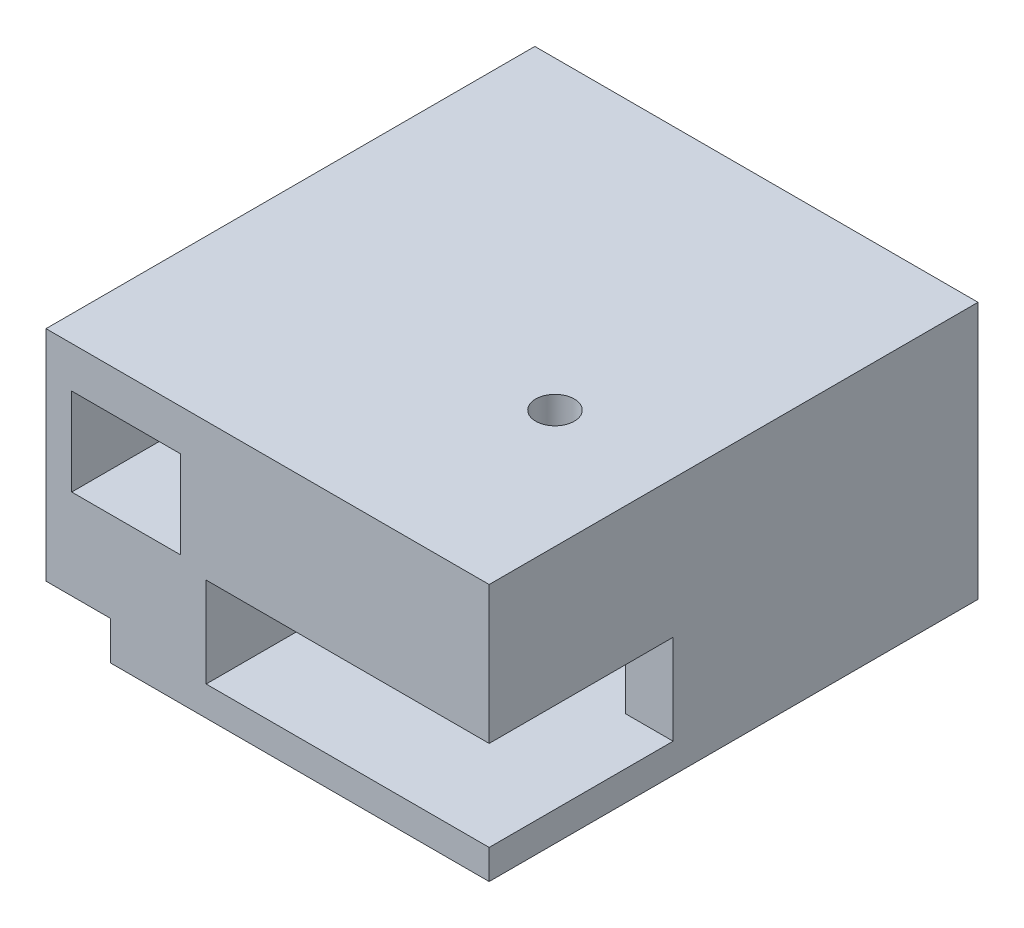
ISO-10303-21;
HEADER;
FILE_DESCRIPTION(('STEP AP214'),'2;1');
FILE_NAME('part.step','',(''),(''),'','','');
FILE_SCHEMA(('AUTOMOTIVE_DESIGN { 1 0 10303 214 1 1 1 1 }'));
ENDSEC;
DATA;
#1=APPLICATION_CONTEXT('core data for automotive mechanical design processes');
#2=APPLICATION_PROTOCOL_DEFINITION('international standard','automotive_design',2000,#1);
#3=PRODUCT_CONTEXT('',#1,'mechanical');
#4=PRODUCT('Part','Part','',(#3));
#5=PRODUCT_RELATED_PRODUCT_CATEGORY('part','',(#4));
#6=PRODUCT_DEFINITION_FORMATION('','',#4);
#7=PRODUCT_DEFINITION_CONTEXT('part definition',#1,'design');
#8=PRODUCT_DEFINITION('design','',#6,#7);
#9=PRODUCT_DEFINITION_SHAPE('','',#8);
#10=(LENGTH_UNIT() NAMED_UNIT(*) SI_UNIT(.MILLI.,.METRE.));
#11=(NAMED_UNIT(*) PLANE_ANGLE_UNIT() SI_UNIT($,.RADIAN.));
#12=(NAMED_UNIT(*) SI_UNIT($,.STERADIAN.) SOLID_ANGLE_UNIT());
#13=UNCERTAINTY_MEASURE_WITH_UNIT(LENGTH_MEASURE(1.E-05),#10,'distance_accuracy_value','');
#14=(GEOMETRIC_REPRESENTATION_CONTEXT(3) GLOBAL_UNCERTAINTY_ASSIGNED_CONTEXT((#13)) GLOBAL_UNIT_ASSIGNED_CONTEXT((#10,
#11,#12)) REPRESENTATION_CONTEXT('',''));
#15=CARTESIAN_POINT('',(0.,0.,0.));
#16=DIRECTION('',(0.,0.,1.));
#17=DIRECTION('',(1.,0.,0.));
#18=AXIS2_PLACEMENT_3D('',#15,#16,#17);
#19=CARTESIAN_POINT('',(12.125,-500000.,0.));
#20=DIRECTION('',(1.,0.,0.));
#21=DIRECTION('',(0.,0.,1.));
#22=AXIS2_PLACEMENT_3D('',#19,#20,#21);
#23=PLANE('',#22);
#24=DIRECTION('',(0.,-1.,0.));
#25=VECTOR('',#24,1.);
#26=CARTESIAN_POINT('',(12.125,28.9501505877455,18.4638204994987));
#27=LINE('',#26,#25);
#28=CARTESIAN_POINT('',(12.125,-2.70000000000437,18.4638204994987));
#29=VERTEX_POINT('',#28);
#30=CARTESIAN_POINT('',(12.125,4.3,18.4638204994987));
#31=VERTEX_POINT('',#30);
#32=EDGE_CURVE('E11',#29,#31,#27,.F.);
#33=ORIENTED_EDGE('',*,*,#32,.T.);
#34=DIRECTION('',(0.,0.,1.));
#35=VECTOR('',#34,1.);
#36=CARTESIAN_POINT('',(12.125,4.3,0.));
#37=LINE('',#36,#35);
#38=CARTESIAN_POINT('',(12.125,4.3,0.));
#39=VERTEX_POINT('',#38);
#40=EDGE_CURVE('E440',#39,#31,#37,.T.);
#41=ORIENTED_EDGE('',*,*,#40,.F.);
#42=DIRECTION('',(0.,1.,0.));
#43=VECTOR('',#42,1.);
#44=CARTESIAN_POINT('',(12.125,-500000.,0.));
#45=LINE('',#44,#43);
#46=CARTESIAN_POINT('',(12.125,-2.70000000011805,0.));
#47=VERTEX_POINT('',#46);
#48=EDGE_CURVE('E328',#47,#39,#45,.T.);
#49=ORIENTED_EDGE('',*,*,#48,.F.);
#50=DIRECTION('',(0.,0.,-1.));
#51=VECTOR('',#50,1.);
#52=CARTESIAN_POINT('',(12.125,-2.70000000000437,0.));
#53=LINE('',#52,#51);
#54=EDGE_CURVE('E321',#29,#47,#53,.T.);
#55=ORIENTED_EDGE('',*,*,#54,.F.);
#56=EDGE_LOOP('',(#33,#41,#49,#55));
#57=FACE_BOUND('',#56,.T.);
#58=ADVANCED_FACE('F43',(#57),#23,.F.);
#59=CARTESIAN_POINT('',(0.,5.,38.));
#60=DIRECTION('',(0.,1.,0.));
#61=DIRECTION('',(-1.,0.,0.));
#62=AXIS2_PLACEMENT_3D('',#59,#60,#61);
#63=PLANE('',#62);
#64=DIRECTION('',(-1.,0.,0.));
#65=VECTOR('',#64,1.);
#66=CARTESIAN_POINT('',(3.82743866176395,5.,7.81246621596943));
#67=LINE('',#66,#65);
#68=CARTESIAN_POINT('',(-4.375,5.,7.81246621596943));
#69=VERTEX_POINT('',#68);
#70=CARTESIAN_POINT('',(-12.825,5.,7.81246621596943));
#71=VERTEX_POINT('',#70);
#72=EDGE_CURVE('E495',#69,#71,#67,.T.);
#73=ORIENTED_EDGE('',*,*,#72,.T.);
#74=DIRECTION('',(0.,0.,1.));
#75=VECTOR('',#74,1.);
#76=CARTESIAN_POINT('',(-12.825,5.,38.));
#77=LINE('',#76,#75);
#78=CARTESIAN_POINT('',(-12.825,5.,38.));
#79=VERTEX_POINT('',#78);
#80=EDGE_CURVE('E442',#71,#79,#77,.T.);
#81=ORIENTED_EDGE('',*,*,#80,.T.);
#82=DIRECTION('',(-1.,0.,0.));
#83=VECTOR('',#82,1.);
#84=CARTESIAN_POINT('',(0.,5.,38.));
#85=LINE('',#84,#83);
#86=CARTESIAN_POINT('',(-4.375,5.,38.));
#87=VERTEX_POINT('',#86);
#88=EDGE_CURVE('E273',#87,#79,#85,.T.);
#89=ORIENTED_EDGE('',*,*,#88,.F.);
#90=DIRECTION('',(0.,0.,-1.));
#91=VECTOR('',#90,1.);
#92=CARTESIAN_POINT('',(-4.375,5.,38.));
#93=LINE('',#92,#91);
#94=EDGE_CURVE('E477',#87,#69,#93,.T.);
#95=ORIENTED_EDGE('',*,*,#94,.T.);
#96=EDGE_LOOP('',(#73,#81,#89,#95));
#97=FACE_BOUND('',#96,.T.);
#98=ADVANCED_FACE('F511',(#97),#63,.T.);
#99=CARTESIAN_POINT('',(0.,-2.7,38.));
#100=DIRECTION('',(0.,1.,0.));
#101=DIRECTION('',(-1.,0.,0.));
#102=AXIS2_PLACEMENT_3D('',#99,#100,#101);
#103=PLANE('',#102);
#104=CARTESIAN_POINT('',(10.44201924,-2.7,23.7));
#105=DIRECTION('',(0.,-1.,0.));
#106=DIRECTION('',(-1.,0.,0.));
#107=AXIS2_PLACEMENT_3D('',#104,#105,#106);
#108=CIRCLE('',#107,1.5);
#109=CARTESIAN_POINT('',(8.94201924000001,-2.7,23.7));
#110=VERTEX_POINT('',#109);
#111=EDGE_CURVE('E398',#110,#110,#108,.F.);
#112=ORIENTED_EDGE('',*,*,#111,.F.);
#113=EDGE_LOOP('',(#112));
#114=FACE_BOUND('',#113,.T.);
#115=DIRECTION('',(-1.,0.,0.));
#116=VECTOR('',#115,1.);
#117=CARTESIAN_POINT('',(0.,-2.7,38.));
#118=LINE('',#117,#116);
#119=CARTESIAN_POINT('',(19.625,-2.7,38.));
#120=VERTEX_POINT('',#119);
#121=CARTESIAN_POINT('',(-2.375,-2.7,38.));
#122=VERTEX_POINT('',#121);
#123=EDGE_CURVE('E230',#120,#122,#118,.T.);
#124=ORIENTED_EDGE('',*,*,#123,.F.);
#125=DIRECTION('',(0.,0.,1.));
#126=VECTOR('',#125,1.);
#127=CARTESIAN_POINT('',(19.625,-2.7,0.));
#128=LINE('',#127,#126);
#129=CARTESIAN_POINT('',(19.625,-2.7,23.7));
#130=VERTEX_POINT('',#129);
#131=EDGE_CURVE('E241',#130,#120,#128,.T.);
#132=ORIENTED_EDGE('',*,*,#131,.F.);
#133=DIRECTION('',(1.,0.,0.));
#134=VECTOR('',#133,1.);
#135=CARTESIAN_POINT('',(0.,-2.7,23.7));
#136=LINE('',#135,#134);
#137=CARTESIAN_POINT('',(15.94201924,-2.7,23.7));
#138=VERTEX_POINT('',#137);
#139=EDGE_CURVE('E431',#138,#130,#136,.T.);
#140=ORIENTED_EDGE('',*,*,#139,.F.);
#141=CARTESIAN_POINT('',(10.44201924,-2.7,23.7));
#142=DIRECTION('',(0.,-1.,0.));
#143=DIRECTION('',(-1.,0.,0.));
#144=AXIS2_PLACEMENT_3D('',#141,#142,#143);
#145=CIRCLE('',#144,5.5);
#146=EDGE_CURVE('E62',#29,#138,#145,.T.);
#147=ORIENTED_EDGE('',*,*,#146,.F.);
#148=ORIENTED_EDGE('',*,*,#54,.T.);
#149=DIRECTION('',(-1.,0.,0.));
#150=VECTOR('',#149,1.);
#151=CARTESIAN_POINT('',(0.,-2.7,0.));
#152=LINE('',#151,#150);
#153=CARTESIAN_POINT('',(-2.375,-2.7,0.));
#154=VERTEX_POINT('',#153);
#155=EDGE_CURVE('E260',#47,#154,#152,.T.);
#156=ORIENTED_EDGE('',*,*,#155,.T.);
#157=DIRECTION('',(0.,0.,-1.));
#158=VECTOR('',#157,1.);
#159=CARTESIAN_POINT('',(-2.375,-2.7,38.));
#160=LINE('',#159,#158);
#161=EDGE_CURVE('E52',#122,#154,#160,.T.);
#162=ORIENTED_EDGE('',*,*,#161,.F.);
#163=EDGE_LOOP('',(#124,#132,#140,#147,#148,#156,#162));
#164=FACE_BOUND('',#163,.T.);
#165=ADVANCED_FACE('F45',(#114,#164),#103,.T.);
#166=CARTESIAN_POINT('',(0.,4.3,38.));
#167=DIRECTION('',(0.,1.,0.));
#168=DIRECTION('',(0.,0.,-1.));
#169=AXIS2_PLACEMENT_3D('',#166,#167,#168);
#170=PLANE('',#169);
#171=DIRECTION('',(0.,0.,-1.));
#172=VECTOR('',#171,1.);
#173=CARTESIAN_POINT('',(-2.375,4.3,38.));
#174=LINE('',#173,#172);
#175=CARTESIAN_POINT('',(-2.375,4.3,38.));
#176=VERTEX_POINT('',#175);
#177=CARTESIAN_POINT('',(-2.375,4.3,0.));
#178=VERTEX_POINT('',#177);
#179=EDGE_CURVE('E280',#176,#178,#174,.T.);
#180=ORIENTED_EDGE('',*,*,#179,.T.);
#181=DIRECTION('',(-1.,0.,0.));
#182=VECTOR('',#181,1.);
#183=CARTESIAN_POINT('',(0.,4.3,0.));
#184=LINE('',#183,#182);
#185=EDGE_CURVE('E330',#39,#178,#184,.T.);
#186=ORIENTED_EDGE('',*,*,#185,.F.);
#187=ORIENTED_EDGE('',*,*,#40,.T.);
#188=CARTESIAN_POINT('',(10.44201924,4.3,23.7));
#189=DIRECTION('',(0.,-1.,0.));
#190=DIRECTION('',(0.,0.,-1.));
#191=AXIS2_PLACEMENT_3D('',#188,#189,#190);
#192=CIRCLE('',#191,5.5);
#193=CARTESIAN_POINT('',(15.94201924,4.3,23.7));
#194=VERTEX_POINT('',#193);
#195=EDGE_CURVE('E428',#31,#194,#192,.T.);
#196=ORIENTED_EDGE('',*,*,#195,.T.);
#197=DIRECTION('',(1.,0.,0.));
#198=VECTOR('',#197,1.);
#199=CARTESIAN_POINT('',(0.,4.3,23.7));
#200=LINE('',#199,#198);
#201=CARTESIAN_POINT('',(19.625,4.3,23.7));
#202=VERTEX_POINT('',#201);
#203=EDGE_CURVE('E424',#194,#202,#200,.T.);
#204=ORIENTED_EDGE('',*,*,#203,.T.);
#205=DIRECTION('',(0.,0.,1.));
#206=VECTOR('',#205,1.);
#207=CARTESIAN_POINT('',(19.625,4.3,0.));
#208=LINE('',#207,#206);
#209=CARTESIAN_POINT('',(19.625,4.3,38.));
#210=VERTEX_POINT('',#209);
#211=EDGE_CURVE('E427',#202,#210,#208,.T.);
#212=ORIENTED_EDGE('',*,*,#211,.T.);
#213=DIRECTION('',(-1.,0.,0.));
#214=VECTOR('',#213,1.);
#215=CARTESIAN_POINT('',(0.,4.3,38.));
#216=LINE('',#215,#214);
#217=EDGE_CURVE('E342',#210,#176,#216,.T.);
#218=ORIENTED_EDGE('',*,*,#217,.T.);
#219=EDGE_LOOP('',(#180,#186,#187,#196,#204,#212,#218));
#220=FACE_BOUND('',#219,.T.);
#221=CARTESIAN_POINT('',(10.44201924,4.3,23.7));
#222=DIRECTION('',(0.,-1.,0.));
#223=DIRECTION('',(0.,0.,-1.));
#224=AXIS2_PLACEMENT_3D('',#221,#222,#223);
#225=CIRCLE('',#224,1.5);
#226=CARTESIAN_POINT('',(10.44201924,4.3,22.2));
#227=VERTEX_POINT('',#226);
#228=EDGE_CURVE('E436',#227,#227,#225,.F.);
#229=ORIENTED_EDGE('',*,*,#228,.T.);
#230=EDGE_LOOP('',(#229));
#231=FACE_BOUND('',#230,.T.);
#232=ADVANCED_FACE('F540',(#220,#231),#170,.F.);
#233=DIRECTION('',(-1.,0.,0.));
#234=VECTOR('',#233,1.);
#235=CARTESIAN_POINT('',(3.82743866176395,5.,3.18753378403057));
#236=LINE('',#235,#234);
#237=CARTESIAN_POINT('',(-12.825,5.,3.18753378403057));
#238=VERTEX_POINT('',#237);
#239=CARTESIAN_POINT('',(-4.375,5.,3.18753378403057));
#240=VERTEX_POINT('',#239);
#241=EDGE_CURVE('E499',#238,#240,#236,.F.);
#242=ORIENTED_EDGE('',*,*,#241,.T.);
#243=CARTESIAN_POINT('',(-4.375,5.,0.));
#244=VERTEX_POINT('',#243);
#245=EDGE_CURVE('E481',#240,#244,#93,.T.);
#246=ORIENTED_EDGE('',*,*,#245,.T.);
#247=DIRECTION('',(-1.,0.,0.));
#248=VECTOR('',#247,1.);
#249=CARTESIAN_POINT('',(0.,5.,0.));
#250=LINE('',#249,#248);
#251=CARTESIAN_POINT('',(-12.825,5.,0.));
#252=VERTEX_POINT('',#251);
#253=EDGE_CURVE('E297',#244,#252,#250,.T.);
#254=ORIENTED_EDGE('',*,*,#253,.T.);
#255=EDGE_CURVE('E393',#252,#238,#77,.T.);
#256=ORIENTED_EDGE('',*,*,#255,.T.);
#257=EDGE_LOOP('',(#242,#246,#254,#256));
#258=FACE_BOUND('',#257,.T.);
#259=ADVANCED_FACE('F527',(#258),#63,.T.);
#260=CARTESIAN_POINT('',(0.,11.8,38.));
#261=DIRECTION('',(0.,1.,0.));
#262=DIRECTION('',(-1.,0.,0.));
#263=AXIS2_PLACEMENT_3D('',#260,#261,#262);
#264=PLANE('',#263);
#265=DIRECTION('',(0.,0.,1.));
#266=VECTOR('',#265,1.);
#267=CARTESIAN_POINT('',(-12.825,11.7999999999938,38.));
#268=LINE('',#267,#266);
#269=CARTESIAN_POINT('',(-12.825,11.7999999999938,0.));
#270=VERTEX_POINT('',#269);
#271=CARTESIAN_POINT('',(-12.825,11.7999999999938,38.));
#272=VERTEX_POINT('',#271);
#273=EDGE_CURVE('E482',#270,#272,#268,.T.);
#274=ORIENTED_EDGE('',*,*,#273,.F.);
#275=DIRECTION('',(-1.,0.,0.));
#276=VECTOR('',#275,1.);
#277=CARTESIAN_POINT('',(0.,11.8,0.));
#278=LINE('',#277,#276);
#279=CARTESIAN_POINT('',(-4.375,11.7999999999938,0.));
#280=VERTEX_POINT('',#279);
#281=EDGE_CURVE('E373',#280,#270,#278,.T.);
#282=ORIENTED_EDGE('',*,*,#281,.F.);
#283=DIRECTION('',(0.,0.,-1.));
#284=VECTOR('',#283,1.);
#285=CARTESIAN_POINT('',(-4.375,11.7999999999938,38.));
#286=LINE('',#285,#284);
#287=CARTESIAN_POINT('',(-4.375,11.8,38.));
#288=VERTEX_POINT('',#287);
#289=EDGE_CURVE('E451',#288,#280,#286,.T.);
#290=ORIENTED_EDGE('',*,*,#289,.F.);
#291=DIRECTION('',(-1.,0.,0.));
#292=VECTOR('',#291,1.);
#293=CARTESIAN_POINT('',(0.,11.8,38.));
#294=LINE('',#293,#292);
#295=EDGE_CURVE('E378',#288,#272,#294,.T.);
#296=ORIENTED_EDGE('',*,*,#295,.T.);
#297=EDGE_LOOP('',(#274,#282,#290,#296));
#298=FACE_BOUND('',#297,.T.);
#299=ADVANCED_FACE('F531',(#298),#264,.F.);
#300=CARTESIAN_POINT('',(-9.825,0.,38.));
#301=DIRECTION('',(-1.,0.,0.));
#302=DIRECTION('',(0.,0.,-1.));
#303=AXIS2_PLACEMENT_3D('',#300,#301,#302);
#304=PLANE('',#303);
#305=DIRECTION('',(0.,0.,-1.));
#306=VECTOR('',#305,1.);
#307=CARTESIAN_POINT('',(-9.825,-5.,38.));
#308=LINE('',#307,#306);
#309=CARTESIAN_POINT('',(-9.825,-5.,38.));
#310=VERTEX_POINT('',#309);
#311=CARTESIAN_POINT('',(-9.825,-5.,16.));
#312=VERTEX_POINT('',#311);
#313=EDGE_CURVE('E304',#310,#312,#308,.T.);
#314=ORIENTED_EDGE('',*,*,#313,.F.);
#315=DIRECTION('',(0.,-1.,0.));
#316=VECTOR('',#315,1.);
#317=CARTESIAN_POINT('',(-9.825,0.,38.));
#318=LINE('',#317,#316);
#319=CARTESIAN_POINT('',(-9.825,-2.,38.));
#320=VERTEX_POINT('',#319);
#321=EDGE_CURVE('E292',#320,#310,#318,.T.);
#322=ORIENTED_EDGE('',*,*,#321,.F.);
#323=DIRECTION('',(0.,0.,-1.));
#324=VECTOR('',#323,1.);
#325=CARTESIAN_POINT('',(-9.825,-2.,38.));
#326=LINE('',#325,#324);
#327=CARTESIAN_POINT('',(-9.825,-2.,16.));
#328=VERTEX_POINT('',#327);
#329=EDGE_CURVE('E308',#320,#328,#326,.T.);
#330=ORIENTED_EDGE('',*,*,#329,.T.);
#331=DIRECTION('',(0.,-1.,0.));
#332=VECTOR('',#331,1.);
#333=CARTESIAN_POINT('',(-9.825,0.,16.));
#334=LINE('',#333,#332);
#335=EDGE_CURVE('E237',#328,#312,#334,.T.);
#336=ORIENTED_EDGE('',*,*,#335,.T.);
#337=EDGE_LOOP('',(#314,#322,#330,#336));
#338=FACE_BOUND('',#337,.T.);
#339=ADVANCED_FACE('F420',(#338),#304,.T.);
#340=CARTESIAN_POINT('',(0.,-2.,38.));
#341=DIRECTION('',(0.,-1.,0.));
#342=DIRECTION('',(0.,0.,1.));
#343=AXIS2_PLACEMENT_3D('',#340,#341,#342);
#344=PLANE('',#343);
#345=ORIENTED_EDGE('',*,*,#329,.F.);
#346=DIRECTION('',(1.,0.,0.));
#347=VECTOR('',#346,1.);
#348=CARTESIAN_POINT('',(0.,-2.,38.));
#349=LINE('',#348,#347);
#350=CARTESIAN_POINT('',(-14.825,-2.,38.));
#351=VERTEX_POINT('',#350);
#352=EDGE_CURVE('E289',#351,#320,#349,.T.);
#353=ORIENTED_EDGE('',*,*,#352,.F.);
#354=DIRECTION('',(0.,0.,-1.));
#355=VECTOR('',#354,1.);
#356=CARTESIAN_POINT('',(-14.825,-2.,38.));
#357=LINE('',#356,#355);
#358=CARTESIAN_POINT('',(-14.825,-2.,16.));
#359=VERTEX_POINT('',#358);
#360=EDGE_CURVE('E294',#351,#359,#357,.T.);
#361=ORIENTED_EDGE('',*,*,#360,.T.);
#362=DIRECTION('',(1.,0.,0.));
#363=VECTOR('',#362,1.);
#364=CARTESIAN_POINT('',(0.,-2.,16.));
#365=LINE('',#364,#363);
#366=EDGE_CURVE('E405',#359,#328,#365,.T.);
#367=ORIENTED_EDGE('',*,*,#366,.T.);
#368=EDGE_LOOP('',(#345,#353,#361,#367));
#369=FACE_BOUND('',#368,.T.);
#370=ADVANCED_FACE('F416',(#369),#344,.T.);
#371=CARTESIAN_POINT('',(-2.375,0.,38.));
#372=DIRECTION('',(-1.,0.,0.));
#373=DIRECTION('',(0.,-1.,0.));
#374=AXIS2_PLACEMENT_3D('',#371,#372,#373);
#375=PLANE('',#374);
#376=ORIENTED_EDGE('',*,*,#179,.F.);
#377=DIRECTION('',(0.,-1.,0.));
#378=VECTOR('',#377,1.);
#379=CARTESIAN_POINT('',(-2.375,0.,38.));
#380=LINE('',#379,#378);
#381=EDGE_CURVE('E270',#176,#122,#380,.T.);
#382=ORIENTED_EDGE('',*,*,#381,.T.);
#383=ORIENTED_EDGE('',*,*,#161,.T.);
#384=DIRECTION('',(0.,-1.,0.));
#385=VECTOR('',#384,1.);
#386=CARTESIAN_POINT('',(-2.375,0.,0.));
#387=LINE('',#386,#385);
#388=EDGE_CURVE('E275',#178,#154,#387,.T.);
#389=ORIENTED_EDGE('',*,*,#388,.F.);
#390=EDGE_LOOP('',(#376,#382,#383,#389));
#391=FACE_BOUND('',#390,.T.);
#392=ADVANCED_FACE('F319',(#391),#375,.F.);
#393=CARTESIAN_POINT('',(0.,-5.,38.));
#394=DIRECTION('',(0.,1.,0.));
#395=DIRECTION('',(-1.,0.,0.));
#396=AXIS2_PLACEMENT_3D('',#393,#394,#395);
#397=PLANE('',#396);
#398=CARTESIAN_POINT('',(10.44201924,-5.,23.7));
#399=DIRECTION('',(0.,-1.,0.));
#400=DIRECTION('',(-1.,0.,0.));
#401=AXIS2_PLACEMENT_3D('',#398,#399,#400);
#402=CIRCLE('',#401,1.5);
#403=CARTESIAN_POINT('',(8.94201924000001,-5.,23.7));
#404=VERTEX_POINT('',#403);
#405=EDGE_CURVE('E465',#404,#404,#402,.F.);
#406=ORIENTED_EDGE('',*,*,#405,.T.);
#407=EDGE_LOOP('',(#406));
#408=FACE_BOUND('',#407,.T.);
#409=DIRECTION('',(-1.,0.,0.));
#410=VECTOR('',#409,1.);
#411=CARTESIAN_POINT('',(0.,-5.,0.));
#412=LINE('',#411,#410);
#413=CARTESIAN_POINT('',(19.625,-5.,0.));
#414=VERTEX_POINT('',#413);
#415=CARTESIAN_POINT('',(-14.825,-5.,0.));
#416=VERTEX_POINT('',#415);
#417=EDGE_CURVE('E253',#414,#416,#412,.T.);
#418=ORIENTED_EDGE('',*,*,#417,.F.);
#419=DIRECTION('',(0.,0.,1.));
#420=VECTOR('',#419,1.);
#421=CARTESIAN_POINT('',(19.625,-5.,0.));
#422=LINE('',#421,#420);
#423=CARTESIAN_POINT('',(19.625,-5.,38.));
#424=VERTEX_POINT('',#423);
#425=EDGE_CURVE('E395',#414,#424,#422,.T.);
#426=ORIENTED_EDGE('',*,*,#425,.T.);
#427=DIRECTION('',(-1.,0.,0.));
#428=VECTOR('',#427,1.);
#429=CARTESIAN_POINT('',(0.,-5.,38.));
#430=LINE('',#429,#428);
#431=EDGE_CURVE('E232',#424,#310,#430,.T.);
#432=ORIENTED_EDGE('',*,*,#431,.T.);
#433=ORIENTED_EDGE('',*,*,#313,.T.);
#434=DIRECTION('',(-1.,0.,0.));
#435=VECTOR('',#434,1.);
#436=CARTESIAN_POINT('',(0.,-5.,16.));
#437=LINE('',#436,#435);
#438=CARTESIAN_POINT('',(-14.825,-5.,16.));
#439=VERTEX_POINT('',#438);
#440=EDGE_CURVE('E372',#312,#439,#437,.T.);
#441=ORIENTED_EDGE('',*,*,#440,.T.);
#442=DIRECTION('',(0.,0.,-1.));
#443=VECTOR('',#442,1.);
#444=CARTESIAN_POINT('',(-14.825,-5.,16.));
#445=LINE('',#444,#443);
#446=EDGE_CURVE('E368',#439,#416,#445,.T.);
#447=ORIENTED_EDGE('',*,*,#446,.T.);
#448=EDGE_LOOP('',(#418,#426,#432,#433,#441,#447));
#449=FACE_BOUND('',#448,.T.);
#450=ADVANCED_FACE('F371',(#408,#449),#397,.F.);
#451=CARTESIAN_POINT('',(0.,0.,38.));
#452=DIRECTION('',(0.,0.,-1.));
#453=DIRECTION('',(1.,0.,0.));
#454=AXIS2_PLACEMENT_3D('',#451,#452,#453);
#455=PLANE('',#454);
#456=DIRECTION('',(0.,1.,0.));
#457=VECTOR('',#456,1.);
#458=CARTESIAN_POINT('',(19.625,-2.7,38.));
#459=LINE('',#458,#457);
#460=CARTESIAN_POINT('',(19.625,15.,38.));
#461=VERTEX_POINT('',#460);
#462=EDGE_CURVE('E238',#210,#461,#459,.T.);
#463=ORIENTED_EDGE('',*,*,#462,.T.);
#464=DIRECTION('',(-1.,0.,0.));
#465=VECTOR('',#464,1.);
#466=CARTESIAN_POINT('',(0.,15.,38.));
#467=LINE('',#466,#465);
#468=CARTESIAN_POINT('',(-14.825,15.,38.));
#469=VERTEX_POINT('',#468);
#470=EDGE_CURVE('E335',#461,#469,#467,.T.);
#471=ORIENTED_EDGE('',*,*,#470,.T.);
#472=DIRECTION('',(0.,1.,0.));
#473=VECTOR('',#472,1.);
#474=CARTESIAN_POINT('',(-14.825,0.,38.));
#475=LINE('',#474,#473);
#476=EDGE_CURVE('E285',#351,#469,#475,.T.);
#477=ORIENTED_EDGE('',*,*,#476,.F.);
#478=ORIENTED_EDGE('',*,*,#352,.T.);
#479=ORIENTED_EDGE('',*,*,#321,.T.);
#480=ORIENTED_EDGE('',*,*,#431,.F.);
#481=EDGE_CURVE('E224',#424,#120,#459,.T.);
#482=ORIENTED_EDGE('',*,*,#481,.T.);
#483=ORIENTED_EDGE('',*,*,#123,.T.);
#484=ORIENTED_EDGE('',*,*,#381,.F.);
#485=ORIENTED_EDGE('',*,*,#217,.F.);
#486=EDGE_LOOP('',(#463,#471,#477,#478,#479,#480,#482,#483,#484,#485));
#487=FACE_BOUND('',#486,.T.);
#488=ORIENTED_EDGE('',*,*,#88,.T.);
#489=DIRECTION('',(0.,-1.,0.));
#490=VECTOR('',#489,1.);
#491=CARTESIAN_POINT('',(-12.8250000001045,500000.,38.));
#492=LINE('',#491,#490);
#493=EDGE_CURVE('E390',#272,#79,#492,.T.);
#494=ORIENTED_EDGE('',*,*,#493,.F.);
#495=ORIENTED_EDGE('',*,*,#295,.F.);
#496=DIRECTION('',(0.,-1.,0.));
#497=VECTOR('',#496,1.);
#498=CARTESIAN_POINT('',(-4.3750000001045,500000.,38.));
#499=LINE('',#498,#497);
#500=EDGE_CURVE('E449',#288,#87,#499,.T.);
#501=ORIENTED_EDGE('',*,*,#500,.T.);
#502=EDGE_LOOP('',(#488,#494,#495,#501));
#503=FACE_BOUND('',#502,.T.);
#504=ADVANCED_FACE('F227',(#487,#503),#455,.F.);
#505=CARTESIAN_POINT('',(0.,0.,0.));
#506=DIRECTION('',(0.,0.,-1.));
#507=DIRECTION('',(1.,0.,0.));
#508=AXIS2_PLACEMENT_3D('',#505,#506,#507);
#509=PLANE('',#508);
#510=ORIENTED_EDGE('',*,*,#48,.T.);
#511=ORIENTED_EDGE('',*,*,#185,.T.);
#512=ORIENTED_EDGE('',*,*,#388,.T.);
#513=ORIENTED_EDGE('',*,*,#155,.F.);
#514=EDGE_LOOP('',(#510,#511,#512,#513));
#515=FACE_BOUND('',#514,.T.);
#516=DIRECTION('',(0.,-1.,0.));
#517=VECTOR('',#516,1.);
#518=CARTESIAN_POINT('',(-12.8250000001045,500000.,0.));
#519=LINE('',#518,#517);
#520=EDGE_CURVE('E392',#270,#252,#519,.T.);
#521=ORIENTED_EDGE('',*,*,#520,.T.);
#522=ORIENTED_EDGE('',*,*,#253,.F.);
#523=DIRECTION('',(0.,-1.,0.));
#524=VECTOR('',#523,1.);
#525=CARTESIAN_POINT('',(-4.3750000001045,500000.,0.));
#526=LINE('',#525,#524);
#527=EDGE_CURVE('E452',#280,#244,#526,.T.);
#528=ORIENTED_EDGE('',*,*,#527,.F.);
#529=ORIENTED_EDGE('',*,*,#281,.T.);
#530=EDGE_LOOP('',(#521,#522,#528,#529));
#531=FACE_BOUND('',#530,.T.);
#532=DIRECTION('',(-1.,0.,0.));
#533=VECTOR('',#532,1.);
#534=CARTESIAN_POINT('',(0.,15.,0.));
#535=LINE('',#534,#533);
#536=CARTESIAN_POINT('',(19.625,15.,0.));
#537=VERTEX_POINT('',#536);
#538=CARTESIAN_POINT('',(-14.825,15.,0.));
#539=VERTEX_POINT('',#538);
#540=EDGE_CURVE('E348',#537,#539,#535,.T.);
#541=ORIENTED_EDGE('',*,*,#540,.F.);
#542=DIRECTION('',(0.,-1.,0.));
#543=VECTOR('',#542,1.);
#544=CARTESIAN_POINT('',(19.625,-2.7,0.));
#545=LINE('',#544,#543);
#546=EDGE_CURVE('E362',#537,#414,#545,.T.);
#547=ORIENTED_EDGE('',*,*,#546,.T.);
#548=ORIENTED_EDGE('',*,*,#417,.T.);
#549=DIRECTION('',(0.,1.,0.));
#550=VECTOR('',#549,1.);
#551=CARTESIAN_POINT('',(-14.825,0.,0.));
#552=LINE('',#551,#550);
#553=EDGE_CURVE('E274',#416,#539,#552,.T.);
#554=ORIENTED_EDGE('',*,*,#553,.T.);
#555=EDGE_LOOP('',(#541,#547,#548,#554));
#556=FACE_BOUND('',#555,.T.);
#557=ADVANCED_FACE('F326',(#515,#531,#556),#509,.T.);
#558=CARTESIAN_POINT('',(-14.825,0.,38.));
#559=DIRECTION('',(1.,0.,0.));
#560=DIRECTION('',(0.,0.,1.));
#561=AXIS2_PLACEMENT_3D('',#558,#559,#560);
#562=PLANE('',#561);
#563=CARTESIAN_POINT('',(-14.825,6.75000000000001,5.5));
#564=DIRECTION('',(1.,0.,0.));
#565=DIRECTION('',(0.,-1.,0.));
#566=AXIS2_PLACEMENT_3D('',#563,#564,#565);
#567=CIRCLE('',#566,1.5);
#568=CARTESIAN_POINT('',(-14.825,5.25000000000001,5.5));
#569=VERTEX_POINT('',#568);
#570=EDGE_CURVE('E457',#569,#569,#567,.T.);
#571=ORIENTED_EDGE('',*,*,#570,.T.);
#572=EDGE_LOOP('',(#571));
#573=FACE_BOUND('',#572,.T.);
#574=ORIENTED_EDGE('',*,*,#553,.F.);
#575=ORIENTED_EDGE('',*,*,#446,.F.);
#576=DIRECTION('',(0.,1.,0.));
#577=VECTOR('',#576,1.);
#578=CARTESIAN_POINT('',(-14.825,0.,16.));
#579=LINE('',#578,#577);
#580=EDGE_CURVE('E381',#439,#359,#579,.T.);
#581=ORIENTED_EDGE('',*,*,#580,.T.);
#582=ORIENTED_EDGE('',*,*,#360,.F.);
#583=ORIENTED_EDGE('',*,*,#476,.T.);
#584=DIRECTION('',(0.,0.,-1.));
#585=VECTOR('',#584,1.);
#586=CARTESIAN_POINT('',(-14.825,15.,38.));
#587=LINE('',#586,#585);
#588=EDGE_CURVE('E353',#469,#539,#587,.T.);
#589=ORIENTED_EDGE('',*,*,#588,.T.);
#590=EDGE_LOOP('',(#574,#575,#581,#582,#583,#589));
#591=FACE_BOUND('',#590,.T.);
#592=ADVANCED_FACE('F367',(#573,#591),#562,.F.);
#593=CARTESIAN_POINT('',(0.,15.,38.));
#594=DIRECTION('',(0.,1.,0.));
#595=DIRECTION('',(-1.,0.,0.));
#596=AXIS2_PLACEMENT_3D('',#593,#594,#595);
#597=PLANE('',#596);
#598=CARTESIAN_POINT('',(10.44201924,15.,23.7));
#599=DIRECTION('',(0.,-1.,0.));
#600=DIRECTION('',(-1.,0.,0.));
#601=AXIS2_PLACEMENT_3D('',#598,#599,#600);
#602=CIRCLE('',#601,1.5);
#603=CARTESIAN_POINT('',(8.94201924,15.,23.7));
#604=VERTEX_POINT('',#603);
#605=EDGE_CURVE('E438',#604,#604,#602,.T.);
#606=ORIENTED_EDGE('',*,*,#605,.T.);
#607=EDGE_LOOP('',(#606));
#608=FACE_BOUND('',#607,.T.);
#609=ORIENTED_EDGE('',*,*,#540,.T.);
#610=ORIENTED_EDGE('',*,*,#588,.F.);
#611=ORIENTED_EDGE('',*,*,#470,.F.);
#612=DIRECTION('',(0.,0.,-1.));
#613=VECTOR('',#612,1.);
#614=CARTESIAN_POINT('',(19.625,15.,0.));
#615=LINE('',#614,#613);
#616=EDGE_CURVE('E359',#461,#537,#615,.T.);
#617=ORIENTED_EDGE('',*,*,#616,.T.);
#618=EDGE_LOOP('',(#609,#610,#611,#617));
#619=FACE_BOUND('',#618,.T.);
#620=ADVANCED_FACE('F358',(#608,#619),#597,.T.);
#621=CARTESIAN_POINT('',(0.,0.,16.));
#622=DIRECTION('',(0.,0.,-1.));
#623=DIRECTION('',(1.,0.,0.));
#624=AXIS2_PLACEMENT_3D('',#621,#622,#623);
#625=PLANE('',#624);
#626=ORIENTED_EDGE('',*,*,#335,.F.);
#627=ORIENTED_EDGE('',*,*,#366,.F.);
#628=ORIENTED_EDGE('',*,*,#580,.F.);
#629=ORIENTED_EDGE('',*,*,#440,.F.);
#630=EDGE_LOOP('',(#626,#627,#628,#629));
#631=FACE_BOUND('',#630,.T.);
#632=ADVANCED_FACE('F413',(#631),#625,.F.);
#633=CARTESIAN_POINT('',(19.625,0.,0.));
#634=DIRECTION('',(1.,0.,0.));
#635=DIRECTION('',(0.,0.,1.));
#636=AXIS2_PLACEMENT_3D('',#633,#634,#635);
#637=PLANE('',#636);
#638=ORIENTED_EDGE('',*,*,#211,.F.);
#639=DIRECTION('',(0.,-1.,0.));
#640=VECTOR('',#639,1.);
#641=CARTESIAN_POINT('',(19.625,28.9501505877455,23.7));
#642=LINE('',#641,#640);
#643=EDGE_CURVE('E244',#202,#130,#642,.T.);
#644=ORIENTED_EDGE('',*,*,#643,.T.);
#645=ORIENTED_EDGE('',*,*,#131,.T.);
#646=ORIENTED_EDGE('',*,*,#481,.F.);
#647=ORIENTED_EDGE('',*,*,#425,.F.);
#648=ORIENTED_EDGE('',*,*,#546,.F.);
#649=ORIENTED_EDGE('',*,*,#616,.F.);
#650=ORIENTED_EDGE('',*,*,#462,.F.);
#651=EDGE_LOOP('',(#638,#644,#645,#646,#647,#648,#649,#650));
#652=FACE_BOUND('',#651,.T.);
#653=ADVANCED_FACE('F243',(#652),#637,.T.);
#654=CARTESIAN_POINT('',(10.44201924,19.2426406871193,23.7));
#655=DIRECTION('',(0.,-1.,0.));
#656=DIRECTION('',(1.,0.,0.));
#657=AXIS2_PLACEMENT_3D('',#654,#655,#656);
#658=CYLINDRICAL_SURFACE('',#657,1.5);
#659=ORIENTED_EDGE('',*,*,#605,.F.);
#660=EDGE_LOOP('',(#659));
#661=FACE_BOUND('',#660,.T.);
#662=ORIENTED_EDGE('',*,*,#228,.F.);
#663=EDGE_LOOP('',(#662));
#664=FACE_BOUND('',#663,.T.);
#665=ADVANCED_FACE('F561',(#661,#664),#658,.F.);
#666=ORIENTED_EDGE('',*,*,#111,.T.);
#667=EDGE_LOOP('',(#666));
#668=FACE_BOUND('',#667,.T.);
#669=ORIENTED_EDGE('',*,*,#405,.F.);
#670=EDGE_LOOP('',(#669));
#671=FACE_BOUND('',#670,.T.);
#672=ADVANCED_FACE('F558',(#668,#671),#658,.F.);
#673=CARTESIAN_POINT('',(-4.3750000001045,500000.,38.));
#674=DIRECTION('',(1.,0.,0.));
#675=DIRECTION('',(0.,1.,0.));
#676=AXIS2_PLACEMENT_3D('',#673,#674,#675);
#677=PLANE('',#676);
#678=ORIENTED_EDGE('',*,*,#94,.F.);
#679=ORIENTED_EDGE('',*,*,#500,.F.);
#680=ORIENTED_EDGE('',*,*,#289,.T.);
#681=ORIENTED_EDGE('',*,*,#527,.T.);
#682=ORIENTED_EDGE('',*,*,#245,.F.);
#683=CARTESIAN_POINT('',(-4.375,6.75000000000001,5.5));
#684=DIRECTION('',(-1.,0.,0.));
#685=DIRECTION('',(0.,1.,0.));
#686=AXIS2_PLACEMENT_3D('',#683,#684,#685);
#687=CIRCLE('',#686,2.9);
#688=EDGE_CURVE('E503',#69,#240,#687,.F.);
#689=ORIENTED_EDGE('',*,*,#688,.F.);
#690=EDGE_LOOP('',(#678,#679,#680,#681,#682,#689));
#691=FACE_BOUND('',#690,.T.);
#692=ADVANCED_FACE('F520',(#691),#677,.F.);
#693=CARTESIAN_POINT('',(-12.8250000001045,500000.,38.));
#694=DIRECTION('',(-1.,0.,0.));
#695=DIRECTION('',(0.,-1.,0.));
#696=AXIS2_PLACEMENT_3D('',#693,#694,#695);
#697=PLANE('',#696);
#698=ORIENTED_EDGE('',*,*,#255,.F.);
#699=ORIENTED_EDGE('',*,*,#520,.F.);
#700=ORIENTED_EDGE('',*,*,#273,.T.);
#701=ORIENTED_EDGE('',*,*,#493,.T.);
#702=ORIENTED_EDGE('',*,*,#80,.F.);
#703=CARTESIAN_POINT('',(-12.825,6.75000000000001,5.5));
#704=DIRECTION('',(1.,0.,0.));
#705=DIRECTION('',(0.,-1.,0.));
#706=AXIS2_PLACEMENT_3D('',#703,#704,#705);
#707=CIRCLE('',#706,2.9);
#708=EDGE_CURVE('E73',#71,#238,#707,.T.);
#709=ORIENTED_EDGE('',*,*,#708,.T.);
#710=EDGE_LOOP('',(#698,#699,#700,#701,#702,#709));
#711=FACE_BOUND('',#710,.T.);
#712=CARTESIAN_POINT('',(-12.825,6.75000000000001,5.5));
#713=DIRECTION('',(1.,0.,0.));
#714=DIRECTION('',(0.,-1.,0.));
#715=AXIS2_PLACEMENT_3D('',#712,#713,#714);
#716=CIRCLE('',#715,1.5);
#717=CARTESIAN_POINT('',(-12.825,5.25000000000001,5.5));
#718=VERTEX_POINT('',#717);
#719=EDGE_CURVE('E491',#718,#718,#716,.F.);
#720=ORIENTED_EDGE('',*,*,#719,.T.);
#721=EDGE_LOOP('',(#720));
#722=FACE_BOUND('',#721,.T.);
#723=ADVANCED_FACE('F513',(#711,#722),#697,.F.);
#724=CARTESIAN_POINT('',(19.626,6.75000000000002,5.5));
#725=DIRECTION('',(-1.,0.,0.));
#726=DIRECTION('',(0.,-1.,0.));
#727=AXIS2_PLACEMENT_3D('',#724,#725,#726);
#728=CYLINDRICAL_SURFACE('',#727,1.5);
#729=ORIENTED_EDGE('',*,*,#570,.F.);
#730=EDGE_LOOP('',(#729));
#731=FACE_BOUND('',#730,.T.);
#732=ORIENTED_EDGE('',*,*,#719,.F.);
#733=EDGE_LOOP('',(#732));
#734=FACE_BOUND('',#733,.T.);
#735=ADVANCED_FACE('F552',(#731,#734),#728,.F.);
#736=CARTESIAN_POINT('',(3.82743866176395,6.75000000000001,5.5));
#737=DIRECTION('',(-1.,0.,0.));
#738=DIRECTION('',(0.,-1.,0.));
#739=AXIS2_PLACEMENT_3D('',#736,#737,#738);
#740=CYLINDRICAL_SURFACE('',#739,2.9);
#741=ORIENTED_EDGE('',*,*,#72,.F.);
#742=ORIENTED_EDGE('',*,*,#688,.T.);
#743=ORIENTED_EDGE('',*,*,#241,.F.);
#744=ORIENTED_EDGE('',*,*,#708,.F.);
#745=EDGE_LOOP('',(#741,#742,#743,#744));
#746=FACE_BOUND('',#745,.T.);
#747=ADVANCED_FACE('F523',(#746),#740,.F.);
#748=CARTESIAN_POINT('',(10.44201924,28.9501505877455,23.7));
#749=DIRECTION('',(0.,-1.,0.));
#750=DIRECTION('',(1.,0.,0.));
#751=AXIS2_PLACEMENT_3D('',#748,#749,#750);
#752=CYLINDRICAL_SURFACE('',#751,5.5);
#753=ORIENTED_EDGE('',*,*,#32,.F.);
#754=ORIENTED_EDGE('',*,*,#146,.T.);
#755=DIRECTION('',(0.,-1.,0.));
#756=VECTOR('',#755,1.);
#757=CARTESIAN_POINT('',(15.94201924,28.9501505877455,23.7));
#758=LINE('',#757,#756);
#759=EDGE_CURVE('E247',#194,#138,#758,.T.);
#760=ORIENTED_EDGE('',*,*,#759,.F.);
#761=ORIENTED_EDGE('',*,*,#195,.F.);
#762=EDGE_LOOP('',(#753,#754,#760,#761));
#763=FACE_BOUND('',#762,.T.);
#764=ADVANCED_FACE('F667',(#763),#752,.F.);
#765=CARTESIAN_POINT('',(0.,28.9501505877455,23.7));
#766=DIRECTION('',(0.,0.,1.));
#767=DIRECTION('',(-1.,0.,0.));
#768=AXIS2_PLACEMENT_3D('',#765,#766,#767);
#769=PLANE('',#768);
#770=ORIENTED_EDGE('',*,*,#203,.F.);
#771=ORIENTED_EDGE('',*,*,#759,.T.);
#772=ORIENTED_EDGE('',*,*,#139,.T.);
#773=ORIENTED_EDGE('',*,*,#643,.F.);
#774=EDGE_LOOP('',(#770,#771,#772,#773));
#775=FACE_BOUND('',#774,.T.);
#776=ADVANCED_FACE('F670',(#775),#769,.T.);
#777=CLOSED_SHELL('',(#58,#98,#165,#232,#259,#299,#339,#370,#392,#450,#504,#557,#592,#620,#632,
#653,#665,#672,#692,#723,#735,#747,#764,#776));
#778=MANIFOLD_SOLID_BREP('B2',#777);
#779=ADVANCED_BREP_SHAPE_REPRESENTATION('',(#18,#778),#14);
#780=SHAPE_DEFINITION_REPRESENTATION(#9,#779);
ENDSEC;
END-ISO-10303-21;
